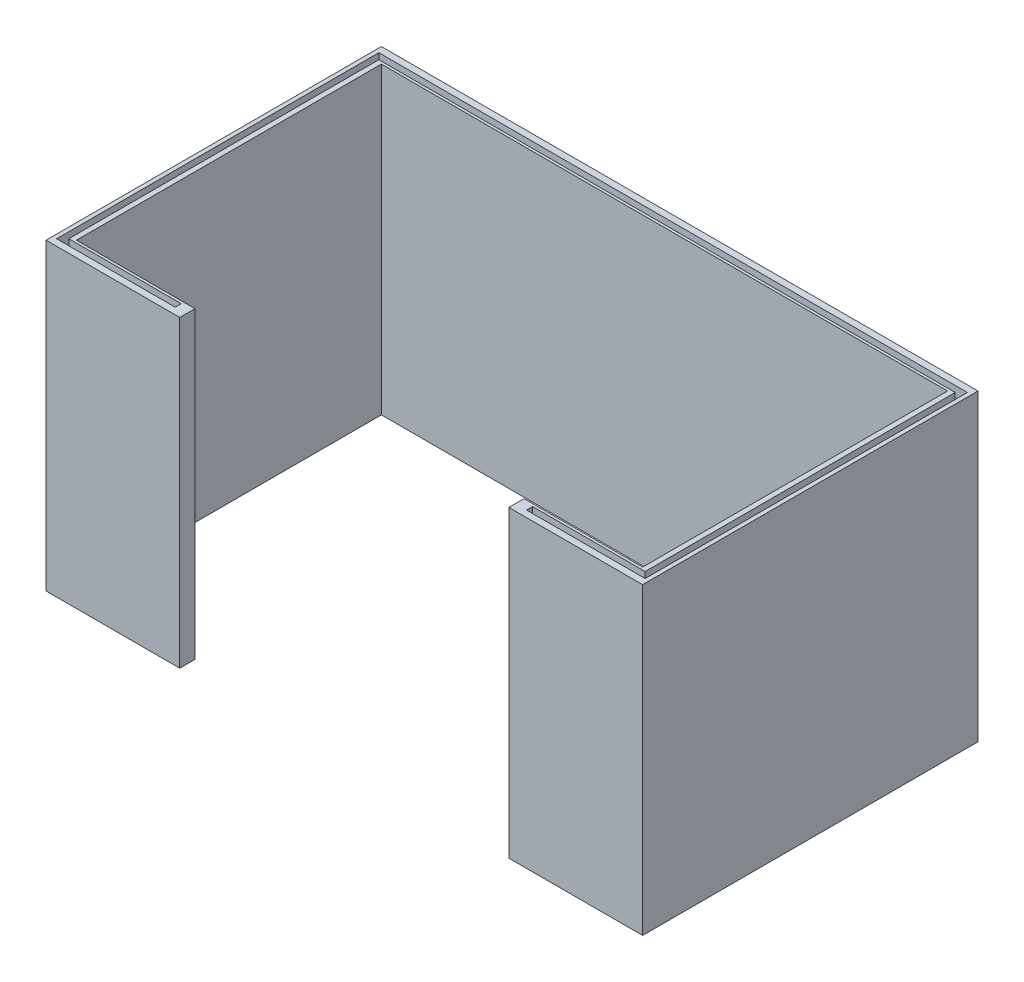
ISO-10303-21;
HEADER;
FILE_DESCRIPTION(('STEP AP214'),'2;1');
FILE_NAME('part.step','',(''),(''),'','','');
FILE_SCHEMA(('AUTOMOTIVE_DESIGN { 1 0 10303 214 1 1 1 1 }'));
ENDSEC;
DATA;
#1=APPLICATION_CONTEXT('core data for automotive mechanical design processes');
#2=APPLICATION_PROTOCOL_DEFINITION('international standard','automotive_design',2000,#1);
#3=PRODUCT_CONTEXT('',#1,'mechanical');
#4=PRODUCT('Part','Part','',(#3));
#5=PRODUCT_RELATED_PRODUCT_CATEGORY('part','',(#4));
#6=PRODUCT_DEFINITION_FORMATION('','',#4);
#7=PRODUCT_DEFINITION_CONTEXT('part definition',#1,'design');
#8=PRODUCT_DEFINITION('design','',#6,#7);
#9=PRODUCT_DEFINITION_SHAPE('','',#8);
#10=(LENGTH_UNIT() NAMED_UNIT(*) SI_UNIT(.MILLI.,.METRE.));
#11=(NAMED_UNIT(*) PLANE_ANGLE_UNIT() SI_UNIT($,.RADIAN.));
#12=(NAMED_UNIT(*) SI_UNIT($,.STERADIAN.) SOLID_ANGLE_UNIT());
#13=UNCERTAINTY_MEASURE_WITH_UNIT(LENGTH_MEASURE(1.E-05),#10,'distance_accuracy_value','');
#14=(GEOMETRIC_REPRESENTATION_CONTEXT(3) GLOBAL_UNCERTAINTY_ASSIGNED_CONTEXT((#13)) GLOBAL_UNIT_ASSIGNED_CONTEXT((#10,
#11,#12)) REPRESENTATION_CONTEXT('',''));
#15=CARTESIAN_POINT('',(0.,0.,0.));
#16=DIRECTION('',(0.,0.,1.));
#17=DIRECTION('',(1.,0.,0.));
#18=AXIS2_PLACEMENT_3D('',#15,#16,#17);
#19=CARTESIAN_POINT('',(-55.915,60.,30.12));
#20=DIRECTION('',(-1.,0.,0.));
#21=DIRECTION('',(0.,0.,1.));
#22=AXIS2_PLACEMENT_3D('',#19,#20,#21);
#23=PLANE('',#22);
#24=DIRECTION('',(0.,0.,-1.));
#25=VECTOR('',#24,1.);
#26=CARTESIAN_POINT('',(-55.915,0.,30.12));
#27=LINE('',#26,#25);
#28=CARTESIAN_POINT('',(-55.915,0.,30.12));
#29=VERTEX_POINT('',#28);
#30=CARTESIAN_POINT('',(-55.915,0.,-30.12));
#31=VERTEX_POINT('',#30);
#32=EDGE_CURVE('E182',#29,#31,#27,.T.);
#33=ORIENTED_EDGE('',*,*,#32,.T.);
#34=DIRECTION('',(0.,-1.,0.));
#35=VECTOR('',#34,1.);
#36=CARTESIAN_POINT('',(-55.915,60.,-30.12));
#37=LINE('',#36,#35);
#38=CARTESIAN_POINT('',(-55.915,60.,-30.12));
#39=VERTEX_POINT('',#38);
#40=EDGE_CURVE('E11',#39,#31,#37,.T.);
#41=ORIENTED_EDGE('',*,*,#40,.F.);
#42=DIRECTION('',(0.,0.,-1.));
#43=VECTOR('',#42,1.);
#44=CARTESIAN_POINT('',(-55.915,60.,30.12));
#45=LINE('',#44,#43);
#46=CARTESIAN_POINT('',(-55.915,60.,30.12));
#47=VERTEX_POINT('',#46);
#48=EDGE_CURVE('E218',#47,#39,#45,.T.);
#49=ORIENTED_EDGE('',*,*,#48,.F.);
#50=DIRECTION('',(0.,-1.,0.));
#51=VECTOR('',#50,1.);
#52=CARTESIAN_POINT('',(-55.915,60.,30.12));
#53=LINE('',#52,#51);
#54=EDGE_CURVE('E178',#47,#29,#53,.T.);
#55=ORIENTED_EDGE('',*,*,#54,.T.);
#56=EDGE_LOOP('',(#33,#41,#49,#55));
#57=FACE_BOUND('',#56,.T.);
#58=ADVANCED_FACE('F45',(#57),#23,.F.);
#59=CARTESIAN_POINT('',(55.915,60.,-30.12));
#60=DIRECTION('',(0.,0.,-1.));
#61=DIRECTION('',(-1.,0.,0.));
#62=AXIS2_PLACEMENT_3D('',#59,#60,#61);
#63=PLANE('',#62);
#64=DIRECTION('',(1.,0.,0.));
#65=VECTOR('',#64,1.);
#66=CARTESIAN_POINT('',(55.915,0.,-30.12));
#67=LINE('',#66,#65);
#68=CARTESIAN_POINT('',(55.915,0.,-30.12));
#69=VERTEX_POINT('',#68);
#70=EDGE_CURVE('E186',#31,#69,#67,.T.);
#71=ORIENTED_EDGE('',*,*,#70,.T.);
#72=DIRECTION('',(0.,-1.,0.));
#73=VECTOR('',#72,1.);
#74=CARTESIAN_POINT('',(55.915,60.,-30.12));
#75=LINE('',#74,#73);
#76=CARTESIAN_POINT('',(55.915,60.,-30.12));
#77=VERTEX_POINT('',#76);
#78=EDGE_CURVE('E53',#77,#69,#75,.T.);
#79=ORIENTED_EDGE('',*,*,#78,.F.);
#80=DIRECTION('',(1.,0.,0.));
#81=VECTOR('',#80,1.);
#82=CARTESIAN_POINT('',(55.915,60.,-30.12));
#83=LINE('',#82,#81);
#84=EDGE_CURVE('E122',#39,#77,#83,.T.);
#85=ORIENTED_EDGE('',*,*,#84,.F.);
#86=ORIENTED_EDGE('',*,*,#40,.T.);
#87=EDGE_LOOP('',(#71,#79,#85,#86));
#88=FACE_BOUND('',#87,.T.);
#89=ADVANCED_FACE('F557',(#88),#63,.F.);
#90=CARTESIAN_POINT('',(55.915,60.,30.12));
#91=DIRECTION('',(1.,0.,0.));
#92=DIRECTION('',(0.,0.,-1.));
#93=AXIS2_PLACEMENT_3D('',#90,#91,#92);
#94=PLANE('',#93);
#95=DIRECTION('',(0.,0.,1.));
#96=VECTOR('',#95,1.);
#97=CARTESIAN_POINT('',(55.915,0.,30.12));
#98=LINE('',#97,#96);
#99=CARTESIAN_POINT('',(55.915,0.,30.12));
#100=VERTEX_POINT('',#99);
#101=EDGE_CURVE('E190',#69,#100,#98,.T.);
#102=ORIENTED_EDGE('',*,*,#101,.T.);
#103=DIRECTION('',(0.,-1.,0.));
#104=VECTOR('',#103,1.);
#105=CARTESIAN_POINT('',(55.915,60.,30.12));
#106=LINE('',#105,#104);
#107=CARTESIAN_POINT('',(55.915,60.,30.12));
#108=VERTEX_POINT('',#107);
#109=EDGE_CURVE('E245',#108,#100,#106,.T.);
#110=ORIENTED_EDGE('',*,*,#109,.F.);
#111=DIRECTION('',(0.,0.,1.));
#112=VECTOR('',#111,1.);
#113=CARTESIAN_POINT('',(55.915,60.,30.12));
#114=LINE('',#113,#112);
#115=EDGE_CURVE('E255',#77,#108,#114,.T.);
#116=ORIENTED_EDGE('',*,*,#115,.F.);
#117=ORIENTED_EDGE('',*,*,#78,.T.);
#118=EDGE_LOOP('',(#102,#110,#116,#117));
#119=FACE_BOUND('',#118,.T.);
#120=ADVANCED_FACE('F253',(#119),#94,.F.);
#121=CARTESIAN_POINT('',(55.915,60.,30.12));
#122=DIRECTION('',(0.,0.,1.));
#123=DIRECTION('',(1.,0.,0.));
#124=AXIS2_PLACEMENT_3D('',#121,#122,#123);
#125=PLANE('',#124);
#126=DIRECTION('',(-1.,0.,0.));
#127=VECTOR('',#126,1.);
#128=CARTESIAN_POINT('',(55.915,0.,30.12));
#129=LINE('',#128,#127);
#130=CARTESIAN_POINT('',(32.5,0.,30.12));
#131=VERTEX_POINT('',#130);
#132=EDGE_CURVE('E193',#100,#131,#129,.T.);
#133=ORIENTED_EDGE('',*,*,#132,.T.);
#134=DIRECTION('',(0.,-1.,0.));
#135=VECTOR('',#134,1.);
#136=CARTESIAN_POINT('',(32.5,60.,30.12));
#137=LINE('',#136,#135);
#138=CARTESIAN_POINT('',(32.5,60.,30.12));
#139=VERTEX_POINT('',#138);
#140=EDGE_CURVE('E241',#139,#131,#137,.T.);
#141=ORIENTED_EDGE('',*,*,#140,.F.);
#142=DIRECTION('',(-1.,0.,0.));
#143=VECTOR('',#142,1.);
#144=CARTESIAN_POINT('',(55.915,60.,30.12));
#145=LINE('',#144,#143);
#146=EDGE_CURVE('E274',#108,#139,#145,.T.);
#147=ORIENTED_EDGE('',*,*,#146,.F.);
#148=ORIENTED_EDGE('',*,*,#109,.T.);
#149=EDGE_LOOP('',(#133,#141,#147,#148));
#150=FACE_BOUND('',#149,.T.);
#151=ADVANCED_FACE('F264',(#150),#125,.F.);
#152=CARTESIAN_POINT('',(32.5,60.,30.12));
#153=DIRECTION('',(1.,0.,0.));
#154=DIRECTION('',(0.,0.,-1.));
#155=AXIS2_PLACEMENT_3D('',#152,#153,#154);
#156=PLANE('',#155);
#157=DIRECTION('',(0.,0.,1.));
#158=VECTOR('',#157,1.);
#159=CARTESIAN_POINT('',(32.5,0.,30.12));
#160=LINE('',#159,#158);
#161=CARTESIAN_POINT('',(32.5,0.,33.1199999999993));
#162=VERTEX_POINT('',#161);
#163=EDGE_CURVE('E196',#131,#162,#160,.T.);
#164=ORIENTED_EDGE('',*,*,#163,.T.);
#165=DIRECTION('',(0.,-1.,0.));
#166=VECTOR('',#165,1.);
#167=CARTESIAN_POINT('',(32.5,60.,33.1199999999993));
#168=LINE('',#167,#166);
#169=CARTESIAN_POINT('',(32.5,60.,33.1199999999993));
#170=VERTEX_POINT('',#169);
#171=EDGE_CURVE('E237',#170,#162,#168,.T.);
#172=ORIENTED_EDGE('',*,*,#171,.F.);
#173=DIRECTION('',(0.,0.,1.));
#174=VECTOR('',#173,1.);
#175=CARTESIAN_POINT('',(32.5,60.,30.12));
#176=LINE('',#175,#174);
#177=EDGE_CURVE('E270',#139,#170,#176,.T.);
#178=ORIENTED_EDGE('',*,*,#177,.F.);
#179=ORIENTED_EDGE('',*,*,#140,.T.);
#180=EDGE_LOOP('',(#164,#172,#178,#179));
#181=FACE_BOUND('',#180,.T.);
#182=ADVANCED_FACE('F268',(#181),#156,.F.);
#183=CARTESIAN_POINT('',(58.915,60.,33.12));
#184=DIRECTION('',(0.,0.,-1.));
#185=DIRECTION('',(-1.,0.,0.));
#186=AXIS2_PLACEMENT_3D('',#183,#184,#185);
#187=PLANE('',#186);
#188=DIRECTION('',(1.,0.,0.));
#189=VECTOR('',#188,1.);
#190=CARTESIAN_POINT('',(58.915,0.,33.12));
#191=LINE('',#190,#189);
#192=CARTESIAN_POINT('',(58.915,0.,33.12));
#193=VERTEX_POINT('',#192);
#194=EDGE_CURVE('E199',#162,#193,#191,.T.);
#195=ORIENTED_EDGE('',*,*,#194,.T.);
#196=DIRECTION('',(0.,-1.,0.));
#197=VECTOR('',#196,1.);
#198=CARTESIAN_POINT('',(58.915,60.,33.12));
#199=LINE('',#198,#197);
#200=CARTESIAN_POINT('',(58.915,60.,33.12));
#201=VERTEX_POINT('',#200);
#202=EDGE_CURVE('E233',#201,#193,#199,.T.);
#203=ORIENTED_EDGE('',*,*,#202,.F.);
#204=DIRECTION('',(1.,0.,0.));
#205=VECTOR('',#204,1.);
#206=CARTESIAN_POINT('',(58.915,60.,33.12));
#207=LINE('',#206,#205);
#208=EDGE_CURVE('E273',#170,#201,#207,.T.);
#209=ORIENTED_EDGE('',*,*,#208,.F.);
#210=ORIENTED_EDGE('',*,*,#171,.T.);
#211=EDGE_LOOP('',(#195,#203,#209,#210));
#212=FACE_BOUND('',#211,.T.);
#213=ADVANCED_FACE('F570',(#212),#187,.F.);
#214=CARTESIAN_POINT('',(58.915,60.,33.12));
#215=DIRECTION('',(-1.,0.,0.));
#216=DIRECTION('',(0.,0.,1.));
#217=AXIS2_PLACEMENT_3D('',#214,#215,#216);
#218=PLANE('',#217);
#219=DIRECTION('',(0.,0.,-1.));
#220=VECTOR('',#219,1.);
#221=CARTESIAN_POINT('',(58.915,0.,33.12));
#222=LINE('',#221,#220);
#223=CARTESIAN_POINT('',(58.915,0.,-33.12));
#224=VERTEX_POINT('',#223);
#225=EDGE_CURVE('E202',#193,#224,#222,.T.);
#226=ORIENTED_EDGE('',*,*,#225,.T.);
#227=DIRECTION('',(0.,-1.,0.));
#228=VECTOR('',#227,1.);
#229=CARTESIAN_POINT('',(58.915,60.,-33.12));
#230=LINE('',#229,#228);
#231=CARTESIAN_POINT('',(58.915,60.,-33.12));
#232=VERTEX_POINT('',#231);
#233=EDGE_CURVE('E229',#232,#224,#230,.T.);
#234=ORIENTED_EDGE('',*,*,#233,.F.);
#235=DIRECTION('',(0.,0.,-1.));
#236=VECTOR('',#235,1.);
#237=CARTESIAN_POINT('',(58.915,60.,33.12));
#238=LINE('',#237,#236);
#239=EDGE_CURVE('E278',#201,#232,#238,.T.);
#240=ORIENTED_EDGE('',*,*,#239,.F.);
#241=ORIENTED_EDGE('',*,*,#202,.T.);
#242=EDGE_LOOP('',(#226,#234,#240,#241));
#243=FACE_BOUND('',#242,.T.);
#244=ADVANCED_FACE('F573',(#243),#218,.F.);
#245=CARTESIAN_POINT('',(58.915,60.,-33.12));
#246=DIRECTION('',(0.,0.,1.));
#247=DIRECTION('',(1.,0.,0.));
#248=AXIS2_PLACEMENT_3D('',#245,#246,#247);
#249=PLANE('',#248);
#250=DIRECTION('',(-1.,0.,0.));
#251=VECTOR('',#250,1.);
#252=CARTESIAN_POINT('',(58.915,0.,-33.12));
#253=LINE('',#252,#251);
#254=CARTESIAN_POINT('',(-58.915,0.,-33.12));
#255=VERTEX_POINT('',#254);
#256=EDGE_CURVE('E205',#224,#255,#253,.T.);
#257=ORIENTED_EDGE('',*,*,#256,.T.);
#258=DIRECTION('',(0.,-1.,0.));
#259=VECTOR('',#258,1.);
#260=CARTESIAN_POINT('',(-58.915,60.,-33.12));
#261=LINE('',#260,#259);
#262=CARTESIAN_POINT('',(-58.915,60.,-33.12));
#263=VERTEX_POINT('',#262);
#264=EDGE_CURVE('E225',#263,#255,#261,.T.);
#265=ORIENTED_EDGE('',*,*,#264,.F.);
#266=DIRECTION('',(-1.,0.,0.));
#267=VECTOR('',#266,1.);
#268=CARTESIAN_POINT('',(58.915,60.,-33.12));
#269=LINE('',#268,#267);
#270=EDGE_CURVE('E285',#232,#263,#269,.T.);
#271=ORIENTED_EDGE('',*,*,#270,.F.);
#272=ORIENTED_EDGE('',*,*,#233,.T.);
#273=EDGE_LOOP('',(#257,#265,#271,#272));
#274=FACE_BOUND('',#273,.T.);
#275=ADVANCED_FACE('F293',(#274),#249,.F.);
#276=CARTESIAN_POINT('',(-58.915,60.,33.12));
#277=DIRECTION('',(1.,0.,0.));
#278=DIRECTION('',(0.,0.,-1.));
#279=AXIS2_PLACEMENT_3D('',#276,#277,#278);
#280=PLANE('',#279);
#281=DIRECTION('',(0.,0.,1.));
#282=VECTOR('',#281,1.);
#283=CARTESIAN_POINT('',(-58.915,0.,33.12));
#284=LINE('',#283,#282);
#285=CARTESIAN_POINT('',(-58.915,0.,33.12));
#286=VERTEX_POINT('',#285);
#287=EDGE_CURVE('E208',#255,#286,#284,.T.);
#288=ORIENTED_EDGE('',*,*,#287,.T.);
#289=DIRECTION('',(0.,-1.,0.));
#290=VECTOR('',#289,1.);
#291=CARTESIAN_POINT('',(-58.915,60.,33.12));
#292=LINE('',#291,#290);
#293=CARTESIAN_POINT('',(-58.915,60.,33.12));
#294=VERTEX_POINT('',#293);
#295=EDGE_CURVE('E171',#294,#286,#292,.T.);
#296=ORIENTED_EDGE('',*,*,#295,.F.);
#297=DIRECTION('',(0.,0.,1.));
#298=VECTOR('',#297,1.);
#299=CARTESIAN_POINT('',(-58.915,60.,33.12));
#300=LINE('',#299,#298);
#301=EDGE_CURVE('E157',#263,#294,#300,.T.);
#302=ORIENTED_EDGE('',*,*,#301,.F.);
#303=ORIENTED_EDGE('',*,*,#264,.T.);
#304=EDGE_LOOP('',(#288,#296,#302,#303));
#305=FACE_BOUND('',#304,.T.);
#306=ADVANCED_FACE('F297',(#305),#280,.F.);
#307=CARTESIAN_POINT('',(-32.5,60.,33.12));
#308=DIRECTION('',(0.,0.,-1.));
#309=DIRECTION('',(-1.,0.,0.));
#310=AXIS2_PLACEMENT_3D('',#307,#308,#309);
#311=PLANE('',#310);
#312=DIRECTION('',(1.,0.,0.));
#313=VECTOR('',#312,1.);
#314=CARTESIAN_POINT('',(-32.5,0.,33.12));
#315=LINE('',#314,#313);
#316=CARTESIAN_POINT('',(-32.5,0.,33.12));
#317=VERTEX_POINT('',#316);
#318=EDGE_CURVE('E167',#286,#317,#315,.T.);
#319=ORIENTED_EDGE('',*,*,#318,.T.);
#320=DIRECTION('',(0.,-1.,0.));
#321=VECTOR('',#320,1.);
#322=CARTESIAN_POINT('',(-32.5,60.,33.12));
#323=LINE('',#322,#321);
#324=CARTESIAN_POINT('',(-32.5,60.,33.12));
#325=VERTEX_POINT('',#324);
#326=EDGE_CURVE('E164',#325,#317,#323,.T.);
#327=ORIENTED_EDGE('',*,*,#326,.F.);
#328=DIRECTION('',(1.,0.,0.));
#329=VECTOR('',#328,1.);
#330=CARTESIAN_POINT('',(-32.5,60.,33.12));
#331=LINE('',#330,#329);
#332=EDGE_CURVE('E150',#294,#325,#331,.T.);
#333=ORIENTED_EDGE('',*,*,#332,.F.);
#334=ORIENTED_EDGE('',*,*,#295,.T.);
#335=EDGE_LOOP('',(#319,#327,#333,#334));
#336=FACE_BOUND('',#335,.T.);
#337=ADVANCED_FACE('F165',(#336),#311,.F.);
#338=CARTESIAN_POINT('',(-32.5,60.,30.12));
#339=DIRECTION('',(-1.,0.,0.));
#340=DIRECTION('',(0.,0.,1.));
#341=AXIS2_PLACEMENT_3D('',#338,#339,#340);
#342=PLANE('',#341);
#343=DIRECTION('',(0.,0.,-1.));
#344=VECTOR('',#343,1.);
#345=CARTESIAN_POINT('',(-32.5,0.,30.12));
#346=LINE('',#345,#344);
#347=CARTESIAN_POINT('',(-32.5,0.,30.12));
#348=VERTEX_POINT('',#347);
#349=EDGE_CURVE('E213',#317,#348,#346,.T.);
#350=ORIENTED_EDGE('',*,*,#349,.T.);
#351=DIRECTION('',(0.,-1.,0.));
#352=VECTOR('',#351,1.);
#353=CARTESIAN_POINT('',(-32.5,60.,30.12));
#354=LINE('',#353,#352);
#355=CARTESIAN_POINT('',(-32.5,60.,30.12));
#356=VERTEX_POINT('',#355);
#357=EDGE_CURVE('E172',#356,#348,#354,.T.);
#358=ORIENTED_EDGE('',*,*,#357,.F.);
#359=DIRECTION('',(0.,0.,-1.));
#360=VECTOR('',#359,1.);
#361=CARTESIAN_POINT('',(-32.5,60.,30.12));
#362=LINE('',#361,#360);
#363=EDGE_CURVE('E154',#325,#356,#362,.T.);
#364=ORIENTED_EDGE('',*,*,#363,.F.);
#365=ORIENTED_EDGE('',*,*,#326,.T.);
#366=EDGE_LOOP('',(#350,#358,#364,#365));
#367=FACE_BOUND('',#366,.T.);
#368=ADVANCED_FACE('F174',(#367),#342,.F.);
#369=CARTESIAN_POINT('',(-32.5,60.,30.12));
#370=DIRECTION('',(0.,0.,1.));
#371=DIRECTION('',(1.,0.,0.));
#372=AXIS2_PLACEMENT_3D('',#369,#370,#371);
#373=PLANE('',#372);
#374=DIRECTION('',(-1.,0.,0.));
#375=VECTOR('',#374,1.);
#376=CARTESIAN_POINT('',(-32.5,0.,30.12));
#377=LINE('',#376,#375);
#378=EDGE_CURVE('E114',#348,#29,#377,.T.);
#379=ORIENTED_EDGE('',*,*,#378,.T.);
#380=ORIENTED_EDGE('',*,*,#54,.F.);
#381=DIRECTION('',(-1.,0.,0.));
#382=VECTOR('',#381,1.);
#383=CARTESIAN_POINT('',(-32.5,60.,30.12));
#384=LINE('',#383,#382);
#385=EDGE_CURVE('E69',#356,#47,#384,.T.);
#386=ORIENTED_EDGE('',*,*,#385,.F.);
#387=ORIENTED_EDGE('',*,*,#357,.T.);
#388=EDGE_LOOP('',(#379,#380,#386,#387));
#389=FACE_BOUND('',#388,.T.);
#390=ADVANCED_FACE('F298',(#389),#373,.F.);
#391=CARTESIAN_POINT('',(0.,60.,0.));
#392=DIRECTION('',(0.,1.,0.));
#393=DIRECTION('',(0.,0.,1.));
#394=AXIS2_PLACEMENT_3D('',#391,#392,#393);
#395=PLANE('',#394);
#396=DIRECTION('',(0.,0.,1.));
#397=VECTOR('',#396,1.);
#398=CARTESIAN_POINT('',(-58.115,60.,31.82));
#399=LINE('',#398,#397);
#400=CARTESIAN_POINT('',(-58.115,60.,-31.82));
#401=VERTEX_POINT('',#400);
#402=CARTESIAN_POINT('',(-58.115,60.,31.82));
#403=VERTEX_POINT('',#402);
#404=EDGE_CURVE('E60',#401,#403,#399,.T.);
#405=ORIENTED_EDGE('',*,*,#404,.F.);
#406=DIRECTION('',(-1.,0.,0.));
#407=VECTOR('',#406,1.);
#408=CARTESIAN_POINT('',(58.115,60.,-31.82));
#409=LINE('',#408,#407);
#410=CARTESIAN_POINT('',(58.115,60.,-31.82));
#411=VERTEX_POINT('',#410);
#412=EDGE_CURVE('E354',#411,#401,#409,.T.);
#413=ORIENTED_EDGE('',*,*,#412,.F.);
#414=DIRECTION('',(0.,0.,-1.));
#415=VECTOR('',#414,1.);
#416=CARTESIAN_POINT('',(58.115,60.,31.82));
#417=LINE('',#416,#415);
#418=CARTESIAN_POINT('',(58.115,60.,31.82));
#419=VERTEX_POINT('',#418);
#420=EDGE_CURVE('E359',#419,#411,#417,.T.);
#421=ORIENTED_EDGE('',*,*,#420,.F.);
#422=DIRECTION('',(1.,0.,0.));
#423=VECTOR('',#422,1.);
#424=CARTESIAN_POINT('',(58.115,60.,31.82));
#425=LINE('',#424,#423);
#426=CARTESIAN_POINT('',(34.7,60.,31.82));
#427=VERTEX_POINT('',#426);
#428=EDGE_CURVE('E363',#427,#419,#425,.T.);
#429=ORIENTED_EDGE('',*,*,#428,.F.);
#430=DIRECTION('',(0.,0.,1.));
#431=VECTOR('',#430,1.);
#432=CARTESIAN_POINT('',(34.7,60.,30.62));
#433=LINE('',#432,#431);
#434=CARTESIAN_POINT('',(34.7,60.,30.62));
#435=VERTEX_POINT('',#434);
#436=EDGE_CURVE('E367',#435,#427,#433,.T.);
#437=ORIENTED_EDGE('',*,*,#436,.F.);
#438=DIRECTION('',(-1.,0.,0.));
#439=VECTOR('',#438,1.);
#440=CARTESIAN_POINT('',(56.915,60.,30.62));
#441=LINE('',#440,#439);
#442=CARTESIAN_POINT('',(56.915,60.,30.62));
#443=VERTEX_POINT('',#442);
#444=EDGE_CURVE('E371',#443,#435,#441,.T.);
#445=ORIENTED_EDGE('',*,*,#444,.F.);
#446=DIRECTION('',(0.,0.,1.));
#447=VECTOR('',#446,1.);
#448=CARTESIAN_POINT('',(56.915,60.,30.62));
#449=LINE('',#448,#447);
#450=CARTESIAN_POINT('',(56.915,60.,-30.62));
#451=VERTEX_POINT('',#450);
#452=EDGE_CURVE('E375',#451,#443,#449,.T.);
#453=ORIENTED_EDGE('',*,*,#452,.F.);
#454=DIRECTION('',(1.,0.,0.));
#455=VECTOR('',#454,1.);
#456=CARTESIAN_POINT('',(56.915,60.,-30.62));
#457=LINE('',#456,#455);
#458=CARTESIAN_POINT('',(-56.915,60.,-30.62));
#459=VERTEX_POINT('',#458);
#460=EDGE_CURVE('E379',#459,#451,#457,.T.);
#461=ORIENTED_EDGE('',*,*,#460,.F.);
#462=DIRECTION('',(0.,0.,-1.));
#463=VECTOR('',#462,1.);
#464=CARTESIAN_POINT('',(-56.915,60.,30.62));
#465=LINE('',#464,#463);
#466=CARTESIAN_POINT('',(-56.915,60.,30.62));
#467=VERTEX_POINT('',#466);
#468=EDGE_CURVE('E383',#467,#459,#465,.T.);
#469=ORIENTED_EDGE('',*,*,#468,.F.);
#470=DIRECTION('',(-1.,0.,0.));
#471=VECTOR('',#470,1.);
#472=CARTESIAN_POINT('',(-34.7,60.,30.62));
#473=LINE('',#472,#471);
#474=CARTESIAN_POINT('',(-34.7,60.,30.62));
#475=VERTEX_POINT('',#474);
#476=EDGE_CURVE('E387',#475,#467,#473,.T.);
#477=ORIENTED_EDGE('',*,*,#476,.F.);
#478=DIRECTION('',(0.,0.,-1.));
#479=VECTOR('',#478,1.);
#480=CARTESIAN_POINT('',(-34.7,60.,30.62));
#481=LINE('',#480,#479);
#482=CARTESIAN_POINT('',(-34.7,60.,31.82));
#483=VERTEX_POINT('',#482);
#484=EDGE_CURVE('E391',#483,#475,#481,.T.);
#485=ORIENTED_EDGE('',*,*,#484,.F.);
#486=DIRECTION('',(1.,0.,0.));
#487=VECTOR('',#486,1.);
#488=CARTESIAN_POINT('',(-34.7,60.,31.82));
#489=LINE('',#488,#487);
#490=EDGE_CURVE('E395',#403,#483,#489,.T.);
#491=ORIENTED_EDGE('',*,*,#490,.F.);
#492=EDGE_LOOP('',(#405,#413,#421,#429,#437,#445,#453,#461,#469,#477,#485,#491));
#493=FACE_BOUND('',#492,.T.);
#494=ORIENTED_EDGE('',*,*,#48,.T.);
#495=ORIENTED_EDGE('',*,*,#84,.T.);
#496=ORIENTED_EDGE('',*,*,#115,.T.);
#497=ORIENTED_EDGE('',*,*,#146,.T.);
#498=ORIENTED_EDGE('',*,*,#177,.T.);
#499=ORIENTED_EDGE('',*,*,#208,.T.);
#500=ORIENTED_EDGE('',*,*,#239,.T.);
#501=ORIENTED_EDGE('',*,*,#270,.T.);
#502=ORIENTED_EDGE('',*,*,#301,.T.);
#503=ORIENTED_EDGE('',*,*,#332,.T.);
#504=ORIENTED_EDGE('',*,*,#363,.T.);
#505=ORIENTED_EDGE('',*,*,#385,.T.);
#506=EDGE_LOOP('',(#494,#495,#496,#497,#498,#499,#500,#501,#502,#503,#504,#505));
#507=FACE_BOUND('',#506,.T.);
#508=ADVANCED_FACE('F152',(#493,#507),#395,.T.);
#509=CARTESIAN_POINT('',(0.,0.,0.));
#510=DIRECTION('',(0.,1.,0.));
#511=DIRECTION('',(0.,0.,1.));
#512=AXIS2_PLACEMENT_3D('',#509,#510,#511);
#513=PLANE('',#512);
#514=ORIENTED_EDGE('',*,*,#32,.F.);
#515=ORIENTED_EDGE('',*,*,#378,.F.);
#516=ORIENTED_EDGE('',*,*,#349,.F.);
#517=ORIENTED_EDGE('',*,*,#318,.F.);
#518=ORIENTED_EDGE('',*,*,#287,.F.);
#519=ORIENTED_EDGE('',*,*,#256,.F.);
#520=ORIENTED_EDGE('',*,*,#225,.F.);
#521=ORIENTED_EDGE('',*,*,#194,.F.);
#522=ORIENTED_EDGE('',*,*,#163,.F.);
#523=ORIENTED_EDGE('',*,*,#132,.F.);
#524=ORIENTED_EDGE('',*,*,#101,.F.);
#525=ORIENTED_EDGE('',*,*,#70,.F.);
#526=EDGE_LOOP('',(#514,#515,#516,#517,#518,#519,#520,#521,#522,#523,#524,#525));
#527=FACE_BOUND('',#526,.T.);
#528=ADVANCED_FACE('F259',(#527),#513,.F.);
#529=CARTESIAN_POINT('',(-58.115,55.,31.82));
#530=DIRECTION('',(-1.,0.,0.));
#531=DIRECTION('',(0.,0.,1.));
#532=AXIS2_PLACEMENT_3D('',#529,#530,#531);
#533=PLANE('',#532);
#534=ORIENTED_EDGE('',*,*,#404,.T.);
#535=DIRECTION('',(0.,1.,0.));
#536=VECTOR('',#535,1.);
#537=CARTESIAN_POINT('',(-58.115,55.,31.82));
#538=LINE('',#537,#536);
#539=CARTESIAN_POINT('',(-58.115,55.,31.82));
#540=VERTEX_POINT('',#539);
#541=EDGE_CURVE('E307',#540,#403,#538,.T.);
#542=ORIENTED_EDGE('',*,*,#541,.F.);
#543=DIRECTION('',(0.,0.,1.));
#544=VECTOR('',#543,1.);
#545=CARTESIAN_POINT('',(-58.115,55.,31.82));
#546=LINE('',#545,#544);
#547=CARTESIAN_POINT('',(-58.115,55.,-31.82));
#548=VERTEX_POINT('',#547);
#549=EDGE_CURVE('E358',#548,#540,#546,.T.);
#550=ORIENTED_EDGE('',*,*,#549,.F.);
#551=DIRECTION('',(0.,1.,0.));
#552=VECTOR('',#551,1.);
#553=CARTESIAN_POINT('',(-58.115,55.,-31.82));
#554=LINE('',#553,#552);
#555=EDGE_CURVE('E187',#548,#401,#554,.T.);
#556=ORIENTED_EDGE('',*,*,#555,.T.);
#557=EDGE_LOOP('',(#534,#542,#550,#556));
#558=FACE_BOUND('',#557,.T.);
#559=ADVANCED_FACE('F454',(#558),#533,.F.);
#560=CARTESIAN_POINT('',(58.115,55.,-31.82));
#561=DIRECTION('',(0.,0.,-1.));
#562=DIRECTION('',(-1.,0.,0.));
#563=AXIS2_PLACEMENT_3D('',#560,#561,#562);
#564=PLANE('',#563);
#565=ORIENTED_EDGE('',*,*,#412,.T.);
#566=ORIENTED_EDGE('',*,*,#555,.F.);
#567=DIRECTION('',(-1.,0.,0.));
#568=VECTOR('',#567,1.);
#569=CARTESIAN_POINT('',(58.115,55.,-31.82));
#570=LINE('',#569,#568);
#571=CARTESIAN_POINT('',(58.115,55.,-31.82));
#572=VERTEX_POINT('',#571);
#573=EDGE_CURVE('E312',#572,#548,#570,.T.);
#574=ORIENTED_EDGE('',*,*,#573,.F.);
#575=DIRECTION('',(0.,1.,0.));
#576=VECTOR('',#575,1.);
#577=CARTESIAN_POINT('',(58.115,55.,-31.82));
#578=LINE('',#577,#576);
#579=EDGE_CURVE('E348',#572,#411,#578,.T.);
#580=ORIENTED_EDGE('',*,*,#579,.T.);
#581=EDGE_LOOP('',(#565,#566,#574,#580));
#582=FACE_BOUND('',#581,.T.);
#583=ADVANCED_FACE('F482',(#582),#564,.F.);
#584=CARTESIAN_POINT('',(58.115,55.,31.82));
#585=DIRECTION('',(1.,0.,0.));
#586=DIRECTION('',(0.,0.,-1.));
#587=AXIS2_PLACEMENT_3D('',#584,#585,#586);
#588=PLANE('',#587);
#589=ORIENTED_EDGE('',*,*,#420,.T.);
#590=ORIENTED_EDGE('',*,*,#579,.F.);
#591=DIRECTION('',(0.,0.,-1.));
#592=VECTOR('',#591,1.);
#593=CARTESIAN_POINT('',(58.115,55.,31.82));
#594=LINE('',#593,#592);
#595=CARTESIAN_POINT('',(58.115,55.,31.82));
#596=VERTEX_POINT('',#595);
#597=EDGE_CURVE('E404',#596,#572,#594,.T.);
#598=ORIENTED_EDGE('',*,*,#597,.F.);
#599=DIRECTION('',(0.,1.,0.));
#600=VECTOR('',#599,1.);
#601=CARTESIAN_POINT('',(58.115,55.,31.82));
#602=LINE('',#601,#600);
#603=EDGE_CURVE('E344',#596,#419,#602,.T.);
#604=ORIENTED_EDGE('',*,*,#603,.T.);
#605=EDGE_LOOP('',(#589,#590,#598,#604));
#606=FACE_BOUND('',#605,.T.);
#607=ADVANCED_FACE('F487',(#606),#588,.F.);
#608=CARTESIAN_POINT('',(58.115,55.,31.82));
#609=DIRECTION('',(0.,0.,1.));
#610=DIRECTION('',(1.,0.,0.));
#611=AXIS2_PLACEMENT_3D('',#608,#609,#610);
#612=PLANE('',#611);
#613=ORIENTED_EDGE('',*,*,#428,.T.);
#614=ORIENTED_EDGE('',*,*,#603,.F.);
#615=DIRECTION('',(1.,0.,0.));
#616=VECTOR('',#615,1.);
#617=CARTESIAN_POINT('',(58.115,55.,31.82));
#618=LINE('',#617,#616);
#619=CARTESIAN_POINT('',(34.7,55.,31.82));
#620=VERTEX_POINT('',#619);
#621=EDGE_CURVE('E408',#620,#596,#618,.T.);
#622=ORIENTED_EDGE('',*,*,#621,.F.);
#623=DIRECTION('',(0.,1.,0.));
#624=VECTOR('',#623,1.);
#625=CARTESIAN_POINT('',(34.7,55.,31.82));
#626=LINE('',#625,#624);
#627=EDGE_CURVE('E340',#620,#427,#626,.T.);
#628=ORIENTED_EDGE('',*,*,#627,.T.);
#629=EDGE_LOOP('',(#613,#614,#622,#628));
#630=FACE_BOUND('',#629,.T.);
#631=ADVANCED_FACE('F525',(#630),#612,.F.);
#632=CARTESIAN_POINT('',(34.7,55.,30.62));
#633=DIRECTION('',(-1.,0.,0.));
#634=DIRECTION('',(0.,0.,1.));
#635=AXIS2_PLACEMENT_3D('',#632,#633,#634);
#636=PLANE('',#635);
#637=ORIENTED_EDGE('',*,*,#436,.T.);
#638=ORIENTED_EDGE('',*,*,#627,.F.);
#639=DIRECTION('',(0.,0.,1.));
#640=VECTOR('',#639,1.);
#641=CARTESIAN_POINT('',(34.7,55.,30.62));
#642=LINE('',#641,#640);
#643=CARTESIAN_POINT('',(34.7,55.,30.62));
#644=VERTEX_POINT('',#643);
#645=EDGE_CURVE('E412',#644,#620,#642,.T.);
#646=ORIENTED_EDGE('',*,*,#645,.F.);
#647=DIRECTION('',(0.,1.,0.));
#648=VECTOR('',#647,1.);
#649=CARTESIAN_POINT('',(34.7,55.,30.62));
#650=LINE('',#649,#648);
#651=EDGE_CURVE('E336',#644,#435,#650,.T.);
#652=ORIENTED_EDGE('',*,*,#651,.T.);
#653=EDGE_LOOP('',(#637,#638,#646,#652));
#654=FACE_BOUND('',#653,.T.);
#655=ADVANCED_FACE('F529',(#654),#636,.F.);
#656=CARTESIAN_POINT('',(56.915,55.,30.62));
#657=DIRECTION('',(0.,0.,-1.));
#658=DIRECTION('',(-1.,0.,0.));
#659=AXIS2_PLACEMENT_3D('',#656,#657,#658);
#660=PLANE('',#659);
#661=ORIENTED_EDGE('',*,*,#444,.T.);
#662=ORIENTED_EDGE('',*,*,#651,.F.);
#663=DIRECTION('',(-1.,0.,0.));
#664=VECTOR('',#663,1.);
#665=CARTESIAN_POINT('',(56.915,55.,30.62));
#666=LINE('',#665,#664);
#667=CARTESIAN_POINT('',(56.915,55.,30.62));
#668=VERTEX_POINT('',#667);
#669=EDGE_CURVE('E416',#668,#644,#666,.T.);
#670=ORIENTED_EDGE('',*,*,#669,.F.);
#671=DIRECTION('',(0.,1.,0.));
#672=VECTOR('',#671,1.);
#673=CARTESIAN_POINT('',(56.915,55.,30.62));
#674=LINE('',#673,#672);
#675=EDGE_CURVE('E332',#668,#443,#674,.T.);
#676=ORIENTED_EDGE('',*,*,#675,.T.);
#677=EDGE_LOOP('',(#661,#662,#670,#676));
#678=FACE_BOUND('',#677,.T.);
#679=ADVANCED_FACE('F535',(#678),#660,.F.);
#680=CARTESIAN_POINT('',(56.915,55.,30.62));
#681=DIRECTION('',(-1.,0.,0.));
#682=DIRECTION('',(0.,0.,1.));
#683=AXIS2_PLACEMENT_3D('',#680,#681,#682);
#684=PLANE('',#683);
#685=ORIENTED_EDGE('',*,*,#452,.T.);
#686=ORIENTED_EDGE('',*,*,#675,.F.);
#687=DIRECTION('',(0.,0.,1.));
#688=VECTOR('',#687,1.);
#689=CARTESIAN_POINT('',(56.915,55.,30.62));
#690=LINE('',#689,#688);
#691=CARTESIAN_POINT('',(56.915,55.,-30.62));
#692=VERTEX_POINT('',#691);
#693=EDGE_CURVE('E420',#692,#668,#690,.T.);
#694=ORIENTED_EDGE('',*,*,#693,.F.);
#695=DIRECTION('',(0.,1.,0.));
#696=VECTOR('',#695,1.);
#697=CARTESIAN_POINT('',(56.915,55.,-30.62));
#698=LINE('',#697,#696);
#699=EDGE_CURVE('E328',#692,#451,#698,.T.);
#700=ORIENTED_EDGE('',*,*,#699,.T.);
#701=EDGE_LOOP('',(#685,#686,#694,#700));
#702=FACE_BOUND('',#701,.T.);
#703=ADVANCED_FACE('F538',(#702),#684,.F.);
#704=CARTESIAN_POINT('',(56.915,55.,-30.62));
#705=DIRECTION('',(0.,0.,1.));
#706=DIRECTION('',(1.,0.,0.));
#707=AXIS2_PLACEMENT_3D('',#704,#705,#706);
#708=PLANE('',#707);
#709=ORIENTED_EDGE('',*,*,#460,.T.);
#710=ORIENTED_EDGE('',*,*,#699,.F.);
#711=DIRECTION('',(1.,0.,0.));
#712=VECTOR('',#711,1.);
#713=CARTESIAN_POINT('',(56.915,55.,-30.62));
#714=LINE('',#713,#712);
#715=CARTESIAN_POINT('',(-56.915,55.,-30.62));
#716=VERTEX_POINT('',#715);
#717=EDGE_CURVE('E424',#716,#692,#714,.T.);
#718=ORIENTED_EDGE('',*,*,#717,.F.);
#719=DIRECTION('',(0.,1.,0.));
#720=VECTOR('',#719,1.);
#721=CARTESIAN_POINT('',(-56.915,55.,-30.62));
#722=LINE('',#721,#720);
#723=EDGE_CURVE('E324',#716,#459,#722,.T.);
#724=ORIENTED_EDGE('',*,*,#723,.T.);
#725=EDGE_LOOP('',(#709,#710,#718,#724));
#726=FACE_BOUND('',#725,.T.);
#727=ADVANCED_FACE('F541',(#726),#708,.F.);
#728=CARTESIAN_POINT('',(-56.915,55.,30.62));
#729=DIRECTION('',(1.,0.,0.));
#730=DIRECTION('',(0.,0.,-1.));
#731=AXIS2_PLACEMENT_3D('',#728,#729,#730);
#732=PLANE('',#731);
#733=ORIENTED_EDGE('',*,*,#468,.T.);
#734=ORIENTED_EDGE('',*,*,#723,.F.);
#735=DIRECTION('',(0.,0.,-1.));
#736=VECTOR('',#735,1.);
#737=CARTESIAN_POINT('',(-56.915,55.,30.62));
#738=LINE('',#737,#736);
#739=CARTESIAN_POINT('',(-56.915,55.,30.62));
#740=VERTEX_POINT('',#739);
#741=EDGE_CURVE('E428',#740,#716,#738,.T.);
#742=ORIENTED_EDGE('',*,*,#741,.F.);
#743=DIRECTION('',(0.,1.,0.));
#744=VECTOR('',#743,1.);
#745=CARTESIAN_POINT('',(-56.915,55.,30.62));
#746=LINE('',#745,#744);
#747=EDGE_CURVE('E320',#740,#467,#746,.T.);
#748=ORIENTED_EDGE('',*,*,#747,.T.);
#749=EDGE_LOOP('',(#733,#734,#742,#748));
#750=FACE_BOUND('',#749,.T.);
#751=ADVANCED_FACE('F544',(#750),#732,.F.);
#752=CARTESIAN_POINT('',(-34.7,55.,30.62));
#753=DIRECTION('',(0.,0.,-1.));
#754=DIRECTION('',(-1.,0.,0.));
#755=AXIS2_PLACEMENT_3D('',#752,#753,#754);
#756=PLANE('',#755);
#757=ORIENTED_EDGE('',*,*,#476,.T.);
#758=ORIENTED_EDGE('',*,*,#747,.F.);
#759=DIRECTION('',(-1.,0.,0.));
#760=VECTOR('',#759,1.);
#761=CARTESIAN_POINT('',(-34.7,55.,30.62));
#762=LINE('',#761,#760);
#763=CARTESIAN_POINT('',(-34.7,55.,30.62));
#764=VERTEX_POINT('',#763);
#765=EDGE_CURVE('E432',#764,#740,#762,.T.);
#766=ORIENTED_EDGE('',*,*,#765,.F.);
#767=DIRECTION('',(0.,1.,0.));
#768=VECTOR('',#767,1.);
#769=CARTESIAN_POINT('',(-34.7,55.,30.62));
#770=LINE('',#769,#768);
#771=EDGE_CURVE('E316',#764,#475,#770,.T.);
#772=ORIENTED_EDGE('',*,*,#771,.T.);
#773=EDGE_LOOP('',(#757,#758,#766,#772));
#774=FACE_BOUND('',#773,.T.);
#775=ADVANCED_FACE('F547',(#774),#756,.F.);
#776=CARTESIAN_POINT('',(-34.7,55.,30.62));
#777=DIRECTION('',(1.,0.,0.));
#778=DIRECTION('',(0.,0.,-1.));
#779=AXIS2_PLACEMENT_3D('',#776,#777,#778);
#780=PLANE('',#779);
#781=ORIENTED_EDGE('',*,*,#484,.T.);
#782=ORIENTED_EDGE('',*,*,#771,.F.);
#783=DIRECTION('',(0.,0.,-1.));
#784=VECTOR('',#783,1.);
#785=CARTESIAN_POINT('',(-34.7,55.,30.62));
#786=LINE('',#785,#784);
#787=CARTESIAN_POINT('',(-34.7,55.,31.82));
#788=VERTEX_POINT('',#787);
#789=EDGE_CURVE('E436',#788,#764,#786,.T.);
#790=ORIENTED_EDGE('',*,*,#789,.F.);
#791=DIRECTION('',(0.,1.,0.));
#792=VECTOR('',#791,1.);
#793=CARTESIAN_POINT('',(-34.7,55.,31.82));
#794=LINE('',#793,#792);
#795=EDGE_CURVE('E311',#788,#483,#794,.T.);
#796=ORIENTED_EDGE('',*,*,#795,.T.);
#797=EDGE_LOOP('',(#781,#782,#790,#796));
#798=FACE_BOUND('',#797,.T.);
#799=ADVANCED_FACE('F502',(#798),#780,.F.);
#800=CARTESIAN_POINT('',(-34.7,55.,31.82));
#801=DIRECTION('',(0.,0.,1.));
#802=DIRECTION('',(1.,0.,0.));
#803=AXIS2_PLACEMENT_3D('',#800,#801,#802);
#804=PLANE('',#803);
#805=ORIENTED_EDGE('',*,*,#490,.T.);
#806=ORIENTED_EDGE('',*,*,#795,.F.);
#807=DIRECTION('',(1.,0.,0.));
#808=VECTOR('',#807,1.);
#809=CARTESIAN_POINT('',(-34.7,55.,31.82));
#810=LINE('',#809,#808);
#811=EDGE_CURVE('E440',#540,#788,#810,.T.);
#812=ORIENTED_EDGE('',*,*,#811,.F.);
#813=ORIENTED_EDGE('',*,*,#541,.T.);
#814=EDGE_LOOP('',(#805,#806,#812,#813));
#815=FACE_BOUND('',#814,.T.);
#816=ADVANCED_FACE('F496',(#815),#804,.F.);
#817=CARTESIAN_POINT('',(0.,55.,0.));
#818=DIRECTION('',(0.,1.,0.));
#819=DIRECTION('',(0.,0.,1.));
#820=AXIS2_PLACEMENT_3D('',#817,#818,#819);
#821=PLANE('',#820);
#822=ORIENTED_EDGE('',*,*,#549,.T.);
#823=ORIENTED_EDGE('',*,*,#811,.T.);
#824=ORIENTED_EDGE('',*,*,#789,.T.);
#825=ORIENTED_EDGE('',*,*,#765,.T.);
#826=ORIENTED_EDGE('',*,*,#741,.T.);
#827=ORIENTED_EDGE('',*,*,#717,.T.);
#828=ORIENTED_EDGE('',*,*,#693,.T.);
#829=ORIENTED_EDGE('',*,*,#669,.T.);
#830=ORIENTED_EDGE('',*,*,#645,.T.);
#831=ORIENTED_EDGE('',*,*,#621,.T.);
#832=ORIENTED_EDGE('',*,*,#597,.T.);
#833=ORIENTED_EDGE('',*,*,#573,.T.);
#834=EDGE_LOOP('',(#822,#823,#824,#825,#826,#827,#828,#829,#830,#831,#832,#833));
#835=FACE_BOUND('',#834,.T.);
#836=ADVANCED_FACE('F449',(#835),#821,.T.);
#837=CLOSED_SHELL('',(#58,#89,#120,#151,#182,#213,#244,#275,#306,#337,#368,#390,#508,#528,#559,
#583,#607,#631,#655,#679,#703,#727,#751,#775,#799,#816,#836));
#838=MANIFOLD_SOLID_BREP('B2',#837);
#839=ADVANCED_BREP_SHAPE_REPRESENTATION('',(#18,#838),#14);
#840=SHAPE_DEFINITION_REPRESENTATION(#9,#839);
ENDSEC;
END-ISO-10303-21;
